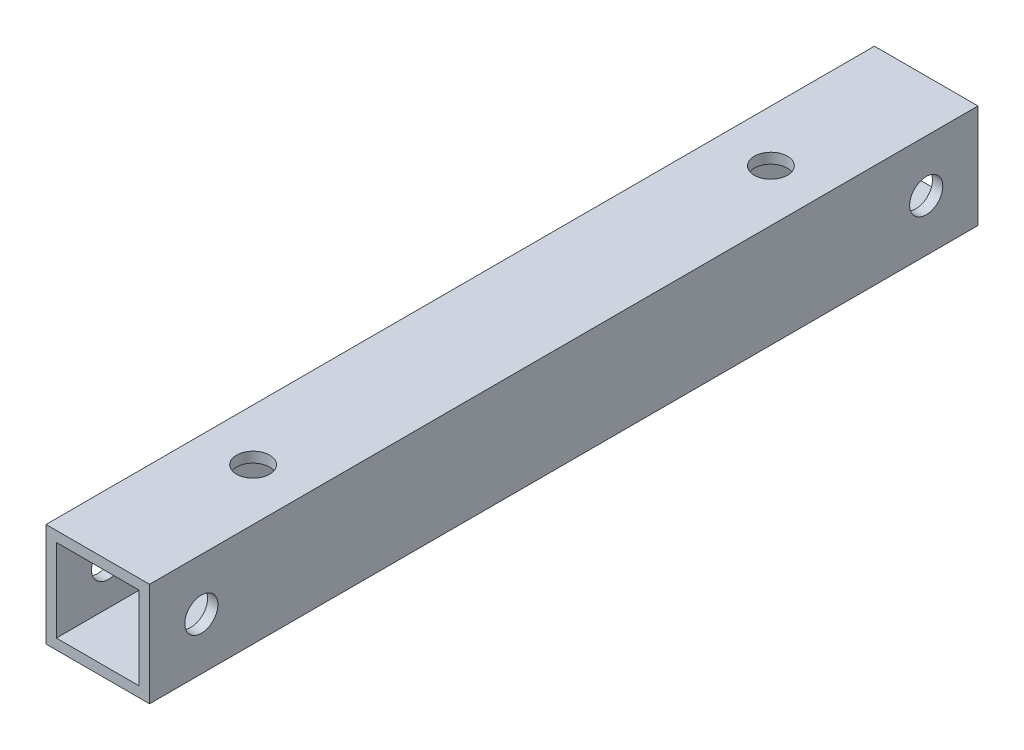
ISO-10303-21;
HEADER;
FILE_DESCRIPTION(('STEP AP214'),'2;1');
FILE_NAME('part.step','',(''),(''),'','','');
FILE_SCHEMA(('AUTOMOTIVE_DESIGN { 1 0 10303 214 1 1 1 1 }'));
ENDSEC;
DATA;
#1=APPLICATION_CONTEXT('core data for automotive mechanical design processes');
#2=APPLICATION_PROTOCOL_DEFINITION('international standard','automotive_design',2000,#1);
#3=PRODUCT_CONTEXT('',#1,'mechanical');
#4=PRODUCT('Part','Part','',(#3));
#5=PRODUCT_RELATED_PRODUCT_CATEGORY('part','',(#4));
#6=PRODUCT_DEFINITION_FORMATION('','',#4);
#7=PRODUCT_DEFINITION_CONTEXT('part definition',#1,'design');
#8=PRODUCT_DEFINITION('design','',#6,#7);
#9=PRODUCT_DEFINITION_SHAPE('','',#8);
#10=(LENGTH_UNIT() NAMED_UNIT(*) SI_UNIT(.MILLI.,.METRE.));
#11=(NAMED_UNIT(*) PLANE_ANGLE_UNIT() SI_UNIT($,.RADIAN.));
#12=(NAMED_UNIT(*) SI_UNIT($,.STERADIAN.) SOLID_ANGLE_UNIT());
#13=UNCERTAINTY_MEASURE_WITH_UNIT(LENGTH_MEASURE(1.E-05),#10,'distance_accuracy_value','');
#14=(GEOMETRIC_REPRESENTATION_CONTEXT(3) GLOBAL_UNCERTAINTY_ASSIGNED_CONTEXT((#13)) GLOBAL_UNIT_ASSIGNED_CONTEXT((#10,
#11,#12)) REPRESENTATION_CONTEXT('',''));
#15=CARTESIAN_POINT('',(0.,0.,0.));
#16=DIRECTION('',(0.,0.,1.));
#17=DIRECTION('',(1.,0.,0.));
#18=AXIS2_PLACEMENT_3D('',#15,#16,#17);
#19=CARTESIAN_POINT('',(0.,0.,0.));
#20=DIRECTION('',(0.,0.,-1.));
#21=DIRECTION('',(-1.,0.,0.));
#22=AXIS2_PLACEMENT_3D('',#19,#20,#21);
#23=PLANE('',#22);
#24=DIRECTION('',(0.,-1.,0.));
#25=VECTOR('',#24,1.);
#26=CARTESIAN_POINT('',(0.,0.,0.));
#27=LINE('',#26,#25);
#28=CARTESIAN_POINT('',(0.,10.,0.));
#29=VERTEX_POINT('',#28);
#30=CARTESIAN_POINT('',(0.,0.,0.));
#31=VERTEX_POINT('',#30);
#32=EDGE_CURVE('E110',#29,#31,#27,.T.);
#33=ORIENTED_EDGE('',*,*,#32,.F.);
#34=DIRECTION('',(-1.,0.,0.));
#35=VECTOR('',#34,1.);
#36=CARTESIAN_POINT('',(0.,10.,0.));
#37=LINE('',#36,#35);
#38=CARTESIAN_POINT('',(10.,10.,0.));
#39=VERTEX_POINT('',#38);
#40=EDGE_CURVE('E58',#39,#29,#37,.T.);
#41=ORIENTED_EDGE('',*,*,#40,.F.);
#42=DIRECTION('',(0.,1.,0.));
#43=VECTOR('',#42,1.);
#44=CARTESIAN_POINT('',(10.,0.,0.));
#45=LINE('',#44,#43);
#46=CARTESIAN_POINT('',(10.,0.,0.));
#47=VERTEX_POINT('',#46);
#48=EDGE_CURVE('E188',#47,#39,#45,.T.);
#49=ORIENTED_EDGE('',*,*,#48,.F.);
#50=DIRECTION('',(1.,0.,0.));
#51=VECTOR('',#50,1.);
#52=CARTESIAN_POINT('',(0.,0.,0.));
#53=LINE('',#52,#51);
#54=EDGE_CURVE('E186',#31,#47,#53,.T.);
#55=ORIENTED_EDGE('',*,*,#54,.F.);
#56=EDGE_LOOP('',(#33,#41,#49,#55));
#57=FACE_BOUND('',#56,.T.);
#58=DIRECTION('',(-1.,0.,0.));
#59=VECTOR('',#58,1.);
#60=CARTESIAN_POINT('',(1.,9.,0.));
#61=LINE('',#60,#59);
#62=CARTESIAN_POINT('',(9.,9.,0.));
#63=VERTEX_POINT('',#62);
#64=CARTESIAN_POINT('',(1.,9.,0.));
#65=VERTEX_POINT('',#64);
#66=EDGE_CURVE('E177',#63,#65,#61,.T.);
#67=ORIENTED_EDGE('',*,*,#66,.T.);
#68=DIRECTION('',(0.,-1.,0.));
#69=VECTOR('',#68,1.);
#70=CARTESIAN_POINT('',(1.,1.,0.));
#71=LINE('',#70,#69);
#72=CARTESIAN_POINT('',(1.,1.,0.));
#73=VERTEX_POINT('',#72);
#74=EDGE_CURVE('E50',#65,#73,#71,.T.);
#75=ORIENTED_EDGE('',*,*,#74,.T.);
#76=DIRECTION('',(1.,0.,0.));
#77=VECTOR('',#76,1.);
#78=CARTESIAN_POINT('',(1.,1.,0.));
#79=LINE('',#78,#77);
#80=CARTESIAN_POINT('',(9.,1.,0.));
#81=VERTEX_POINT('',#80);
#82=EDGE_CURVE('E109',#73,#81,#79,.T.);
#83=ORIENTED_EDGE('',*,*,#82,.T.);
#84=DIRECTION('',(0.,1.,0.));
#85=VECTOR('',#84,1.);
#86=CARTESIAN_POINT('',(9.,1.,0.));
#87=LINE('',#86,#85);
#88=EDGE_CURVE('E174',#81,#63,#87,.T.);
#89=ORIENTED_EDGE('',*,*,#88,.T.);
#90=EDGE_LOOP('',(#67,#75,#83,#89));
#91=FACE_BOUND('',#90,.T.);
#92=ADVANCED_FACE('F33',(#57,#91),#23,.T.);
#93=CARTESIAN_POINT('',(0.,0.,40.));
#94=DIRECTION('',(1.,0.,0.));
#95=DIRECTION('',(0.,0.,-1.));
#96=AXIS2_PLACEMENT_3D('',#93,#94,#95);
#97=PLANE('',#96);
#98=CARTESIAN_POINT('',(0.,5.,5.));
#99=DIRECTION('',(1.,0.,0.));
#100=DIRECTION('',(0.,0.,-1.));
#101=AXIS2_PLACEMENT_3D('',#98,#99,#100);
#102=CIRCLE('',#101,1.6);
#103=CARTESIAN_POINT('',(0.,5.,3.4));
#104=VERTEX_POINT('',#103);
#105=EDGE_CURVE('E163',#104,#104,#102,.T.);
#106=ORIENTED_EDGE('',*,*,#105,.T.);
#107=EDGE_LOOP('',(#106));
#108=FACE_BOUND('',#107,.T.);
#109=ORIENTED_EDGE('',*,*,#32,.T.);
#110=DIRECTION('',(0.,0.,-1.));
#111=VECTOR('',#110,1.);
#112=CARTESIAN_POINT('',(0.,0.,40.));
#113=LINE('',#112,#111);
#114=CARTESIAN_POINT('',(0.,0.,80.));
#115=VERTEX_POINT('',#114);
#116=EDGE_CURVE('E11',#115,#31,#113,.T.);
#117=ORIENTED_EDGE('',*,*,#116,.F.);
#118=DIRECTION('',(0.,-1.,0.));
#119=VECTOR('',#118,1.);
#120=CARTESIAN_POINT('',(0.,0.,80.));
#121=LINE('',#120,#119);
#122=CARTESIAN_POINT('',(0.,10.,80.));
#123=VERTEX_POINT('',#122);
#124=EDGE_CURVE('E132',#123,#115,#121,.T.);
#125=ORIENTED_EDGE('',*,*,#124,.F.);
#126=DIRECTION('',(0.,0.,-1.));
#127=VECTOR('',#126,1.);
#128=CARTESIAN_POINT('',(0.,10.,40.));
#129=LINE('',#128,#127);
#130=EDGE_CURVE('E191',#123,#29,#129,.T.);
#131=ORIENTED_EDGE('',*,*,#130,.T.);
#132=EDGE_LOOP('',(#109,#117,#125,#131));
#133=FACE_BOUND('',#132,.T.);
#134=CARTESIAN_POINT('',(0.,5.,75.));
#135=DIRECTION('',(-1.,0.,0.));
#136=DIRECTION('',(0.,0.,1.));
#137=AXIS2_PLACEMENT_3D('',#134,#135,#136);
#138=CIRCLE('',#137,1.6);
#139=CARTESIAN_POINT('',(0.,5.,76.6));
#140=VERTEX_POINT('',#139);
#141=EDGE_CURVE('E148',#140,#140,#138,.T.);
#142=ORIENTED_EDGE('',*,*,#141,.F.);
#143=EDGE_LOOP('',(#142));
#144=FACE_BOUND('',#143,.T.);
#145=ADVANCED_FACE('F35',(#108,#133,#144),#97,.F.);
#146=CARTESIAN_POINT('',(0.,0.,40.));
#147=DIRECTION('',(0.,1.,0.));
#148=DIRECTION('',(0.,0.,1.));
#149=AXIS2_PLACEMENT_3D('',#146,#147,#148);
#150=PLANE('',#149);
#151=CARTESIAN_POINT('',(5.,0.,15.));
#152=DIRECTION('',(0.,1.,0.));
#153=DIRECTION('',(0.,0.,1.));
#154=AXIS2_PLACEMENT_3D('',#151,#152,#153);
#155=CIRCLE('',#154,1.6);
#156=CARTESIAN_POINT('',(5.,0.,16.6));
#157=VERTEX_POINT('',#156);
#158=EDGE_CURVE('E154',#157,#157,#155,.T.);
#159=ORIENTED_EDGE('',*,*,#158,.T.);
#160=EDGE_LOOP('',(#159));
#161=FACE_BOUND('',#160,.T.);
#162=ORIENTED_EDGE('',*,*,#54,.T.);
#163=DIRECTION('',(0.,0.,-1.));
#164=VECTOR('',#163,1.);
#165=CARTESIAN_POINT('',(10.,0.,40.));
#166=LINE('',#165,#164);
#167=CARTESIAN_POINT('',(10.,0.,80.));
#168=VERTEX_POINT('',#167);
#169=EDGE_CURVE('E42',#168,#47,#166,.T.);
#170=ORIENTED_EDGE('',*,*,#169,.F.);
#171=DIRECTION('',(1.,0.,0.));
#172=VECTOR('',#171,1.);
#173=CARTESIAN_POINT('',(0.,0.,80.));
#174=LINE('',#173,#172);
#175=EDGE_CURVE('E135',#115,#168,#174,.T.);
#176=ORIENTED_EDGE('',*,*,#175,.F.);
#177=ORIENTED_EDGE('',*,*,#116,.T.);
#178=EDGE_LOOP('',(#162,#170,#176,#177));
#179=FACE_BOUND('',#178,.T.);
#180=CARTESIAN_POINT('',(5.,0.,65.));
#181=DIRECTION('',(0.,-1.,0.));
#182=DIRECTION('',(0.,0.,-1.));
#183=AXIS2_PLACEMENT_3D('',#180,#181,#182);
#184=CIRCLE('',#183,1.6);
#185=CARTESIAN_POINT('',(5.,0.,63.4));
#186=VERTEX_POINT('',#185);
#187=EDGE_CURVE('E153',#186,#186,#184,.T.);
#188=ORIENTED_EDGE('',*,*,#187,.F.);
#189=EDGE_LOOP('',(#188));
#190=FACE_BOUND('',#189,.T.);
#191=ADVANCED_FACE('F234',(#161,#179,#190),#150,.F.);
#192=CARTESIAN_POINT('',(10.,0.,40.));
#193=DIRECTION('',(-1.,0.,0.));
#194=DIRECTION('',(0.,0.,1.));
#195=AXIS2_PLACEMENT_3D('',#192,#193,#194);
#196=PLANE('',#195);
#197=CARTESIAN_POINT('',(10.,5.,5.));
#198=DIRECTION('',(1.,0.,0.));
#199=DIRECTION('',(0.,0.,-1.));
#200=AXIS2_PLACEMENT_3D('',#197,#198,#199);
#201=CIRCLE('',#200,1.6);
#202=CARTESIAN_POINT('',(10.,5.,3.4));
#203=VERTEX_POINT('',#202);
#204=EDGE_CURVE('E162',#203,#203,#201,.T.);
#205=ORIENTED_EDGE('',*,*,#204,.F.);
#206=EDGE_LOOP('',(#205));
#207=FACE_BOUND('',#206,.T.);
#208=ORIENTED_EDGE('',*,*,#48,.T.);
#209=DIRECTION('',(0.,0.,-1.));
#210=VECTOR('',#209,1.);
#211=CARTESIAN_POINT('',(10.,10.,40.));
#212=LINE('',#211,#210);
#213=CARTESIAN_POINT('',(10.,10.,80.));
#214=VERTEX_POINT('',#213);
#215=EDGE_CURVE('E193',#214,#39,#212,.T.);
#216=ORIENTED_EDGE('',*,*,#215,.F.);
#217=DIRECTION('',(0.,1.,0.));
#218=VECTOR('',#217,1.);
#219=CARTESIAN_POINT('',(10.,0.,80.));
#220=LINE('',#219,#218);
#221=EDGE_CURVE('E138',#168,#214,#220,.T.);
#222=ORIENTED_EDGE('',*,*,#221,.F.);
#223=ORIENTED_EDGE('',*,*,#169,.T.);
#224=EDGE_LOOP('',(#208,#216,#222,#223));
#225=FACE_BOUND('',#224,.T.);
#226=CARTESIAN_POINT('',(10.,5.,75.));
#227=DIRECTION('',(-1.,0.,0.));
#228=DIRECTION('',(0.,0.,1.));
#229=AXIS2_PLACEMENT_3D('',#226,#227,#228);
#230=CIRCLE('',#229,1.6);
#231=CARTESIAN_POINT('',(10.,5.,76.6));
#232=VERTEX_POINT('',#231);
#233=EDGE_CURVE('E218',#232,#232,#230,.T.);
#234=ORIENTED_EDGE('',*,*,#233,.T.);
#235=EDGE_LOOP('',(#234));
#236=FACE_BOUND('',#235,.T.);
#237=ADVANCED_FACE('F240',(#207,#225,#236),#196,.F.);
#238=CARTESIAN_POINT('',(0.,10.,40.));
#239=DIRECTION('',(0.,-1.,0.));
#240=DIRECTION('',(0.,0.,-1.));
#241=AXIS2_PLACEMENT_3D('',#238,#239,#240);
#242=PLANE('',#241);
#243=CARTESIAN_POINT('',(5.,10.,15.));
#244=DIRECTION('',(0.,1.,0.));
#245=DIRECTION('',(0.,0.,1.));
#246=AXIS2_PLACEMENT_3D('',#243,#244,#245);
#247=CIRCLE('',#246,1.6);
#248=CARTESIAN_POINT('',(5.,10.,16.6));
#249=VERTEX_POINT('',#248);
#250=EDGE_CURVE('E144',#249,#249,#247,.T.);
#251=ORIENTED_EDGE('',*,*,#250,.F.);
#252=EDGE_LOOP('',(#251));
#253=FACE_BOUND('',#252,.T.);
#254=ORIENTED_EDGE('',*,*,#40,.T.);
#255=ORIENTED_EDGE('',*,*,#130,.F.);
#256=DIRECTION('',(-1.,0.,0.));
#257=VECTOR('',#256,1.);
#258=CARTESIAN_POINT('',(0.,10.,80.));
#259=LINE('',#258,#257);
#260=EDGE_CURVE('E141',#214,#123,#259,.T.);
#261=ORIENTED_EDGE('',*,*,#260,.F.);
#262=ORIENTED_EDGE('',*,*,#215,.T.);
#263=EDGE_LOOP('',(#254,#255,#261,#262));
#264=FACE_BOUND('',#263,.T.);
#265=CARTESIAN_POINT('',(5.,10.,65.));
#266=DIRECTION('',(0.,-1.,0.));
#267=DIRECTION('',(0.,0.,-1.));
#268=AXIS2_PLACEMENT_3D('',#265,#266,#267);
#269=CIRCLE('',#268,1.6);
#270=CARTESIAN_POINT('',(5.,10.,63.4));
#271=VERTEX_POINT('',#270);
#272=EDGE_CURVE('E299',#271,#271,#269,.T.);
#273=ORIENTED_EDGE('',*,*,#272,.T.);
#274=EDGE_LOOP('',(#273));
#275=FACE_BOUND('',#274,.T.);
#276=ADVANCED_FACE('F256',(#253,#264,#275),#242,.F.);
#277=CARTESIAN_POINT('',(1.,1.,40.));
#278=DIRECTION('',(1.,0.,0.));
#279=DIRECTION('',(0.,0.,-1.));
#280=AXIS2_PLACEMENT_3D('',#277,#278,#279);
#281=PLANE('',#280);
#282=CARTESIAN_POINT('',(1.,5.,5.));
#283=DIRECTION('',(1.,0.,0.));
#284=DIRECTION('',(0.,0.,-1.));
#285=AXIS2_PLACEMENT_3D('',#282,#283,#284);
#286=CIRCLE('',#285,1.6);
#287=CARTESIAN_POINT('',(1.,5.,3.4));
#288=VERTEX_POINT('',#287);
#289=EDGE_CURVE('E169',#288,#288,#286,.T.);
#290=ORIENTED_EDGE('',*,*,#289,.F.);
#291=EDGE_LOOP('',(#290));
#292=FACE_BOUND('',#291,.T.);
#293=ORIENTED_EDGE('',*,*,#74,.F.);
#294=DIRECTION('',(0.,0.,-1.));
#295=VECTOR('',#294,1.);
#296=CARTESIAN_POINT('',(1.,9.,40.));
#297=LINE('',#296,#295);
#298=CARTESIAN_POINT('',(1.,9.,80.));
#299=VERTEX_POINT('',#298);
#300=EDGE_CURVE('E117',#299,#65,#297,.T.);
#301=ORIENTED_EDGE('',*,*,#300,.F.);
#302=DIRECTION('',(0.,-1.,0.));
#303=VECTOR('',#302,1.);
#304=CARTESIAN_POINT('',(1.,1.,80.));
#305=LINE('',#304,#303);
#306=CARTESIAN_POINT('',(1.,1.,80.));
#307=VERTEX_POINT('',#306);
#308=EDGE_CURVE('E114',#299,#307,#305,.T.);
#309=ORIENTED_EDGE('',*,*,#308,.T.);
#310=DIRECTION('',(0.,0.,-1.));
#311=VECTOR('',#310,1.);
#312=CARTESIAN_POINT('',(1.,1.,40.));
#313=LINE('',#312,#311);
#314=EDGE_CURVE('E101',#307,#73,#313,.T.);
#315=ORIENTED_EDGE('',*,*,#314,.T.);
#316=EDGE_LOOP('',(#293,#301,#309,#315));
#317=FACE_BOUND('',#316,.T.);
#318=CARTESIAN_POINT('',(1.,5.,75.));
#319=DIRECTION('',(-1.,0.,0.));
#320=DIRECTION('',(0.,0.,1.));
#321=AXIS2_PLACEMENT_3D('',#318,#319,#320);
#322=CIRCLE('',#321,1.6);
#323=CARTESIAN_POINT('',(1.,5.,76.6));
#324=VERTEX_POINT('',#323);
#325=EDGE_CURVE('E121',#324,#324,#322,.T.);
#326=ORIENTED_EDGE('',*,*,#325,.T.);
#327=EDGE_LOOP('',(#326));
#328=FACE_BOUND('',#327,.T.);
#329=ADVANCED_FACE('F115',(#292,#317,#328),#281,.T.);
#330=CARTESIAN_POINT('',(1.,1.,40.));
#331=DIRECTION('',(0.,1.,0.));
#332=DIRECTION('',(0.,0.,1.));
#333=AXIS2_PLACEMENT_3D('',#330,#331,#332);
#334=PLANE('',#333);
#335=CARTESIAN_POINT('',(5.,1.,15.));
#336=DIRECTION('',(0.,1.,0.));
#337=DIRECTION('',(0.,0.,1.));
#338=AXIS2_PLACEMENT_3D('',#335,#336,#337);
#339=CIRCLE('',#338,1.6);
#340=CARTESIAN_POINT('',(5.,1.,16.6));
#341=VERTEX_POINT('',#340);
#342=EDGE_CURVE('E159',#341,#341,#339,.T.);
#343=ORIENTED_EDGE('',*,*,#342,.F.);
#344=EDGE_LOOP('',(#343));
#345=FACE_BOUND('',#344,.T.);
#346=ORIENTED_EDGE('',*,*,#82,.F.);
#347=ORIENTED_EDGE('',*,*,#314,.F.);
#348=DIRECTION('',(1.,0.,0.));
#349=VECTOR('',#348,1.);
#350=CARTESIAN_POINT('',(1.,1.,80.));
#351=LINE('',#350,#349);
#352=CARTESIAN_POINT('',(9.,1.,80.));
#353=VERTEX_POINT('',#352);
#354=EDGE_CURVE('E106',#307,#353,#351,.T.);
#355=ORIENTED_EDGE('',*,*,#354,.T.);
#356=DIRECTION('',(0.,0.,-1.));
#357=VECTOR('',#356,1.);
#358=CARTESIAN_POINT('',(9.,1.,40.));
#359=LINE('',#358,#357);
#360=EDGE_CURVE('E111',#353,#81,#359,.T.);
#361=ORIENTED_EDGE('',*,*,#360,.T.);
#362=EDGE_LOOP('',(#346,#347,#355,#361));
#363=FACE_BOUND('',#362,.T.);
#364=CARTESIAN_POINT('',(5.,1.,65.));
#365=DIRECTION('',(0.,-1.,0.));
#366=DIRECTION('',(0.,0.,-1.));
#367=AXIS2_PLACEMENT_3D('',#364,#365,#366);
#368=CIRCLE('',#367,1.6);
#369=CARTESIAN_POINT('',(5.,1.,63.4));
#370=VERTEX_POINT('',#369);
#371=EDGE_CURVE('E152',#370,#370,#368,.T.);
#372=ORIENTED_EDGE('',*,*,#371,.T.);
#373=EDGE_LOOP('',(#372));
#374=FACE_BOUND('',#373,.T.);
#375=ADVANCED_FACE('F103',(#345,#363,#374),#334,.T.);
#376=CARTESIAN_POINT('',(9.,1.,40.));
#377=DIRECTION('',(-1.,0.,0.));
#378=DIRECTION('',(0.,0.,1.));
#379=AXIS2_PLACEMENT_3D('',#376,#377,#378);
#380=PLANE('',#379);
#381=CARTESIAN_POINT('',(9.,5.,5.));
#382=DIRECTION('',(-1.,0.,0.));
#383=DIRECTION('',(0.,0.,1.));
#384=AXIS2_PLACEMENT_3D('',#381,#382,#383);
#385=CIRCLE('',#384,1.6);
#386=CARTESIAN_POINT('',(9.,5.,6.6));
#387=VERTEX_POINT('',#386);
#388=EDGE_CURVE('E166',#387,#387,#385,.T.);
#389=ORIENTED_EDGE('',*,*,#388,.F.);
#390=EDGE_LOOP('',(#389));
#391=FACE_BOUND('',#390,.T.);
#392=ORIENTED_EDGE('',*,*,#88,.F.);
#393=ORIENTED_EDGE('',*,*,#360,.F.);
#394=DIRECTION('',(0.,1.,0.));
#395=VECTOR('',#394,1.);
#396=CARTESIAN_POINT('',(9.,1.,80.));
#397=LINE('',#396,#395);
#398=CARTESIAN_POINT('',(9.,9.,80.));
#399=VERTEX_POINT('',#398);
#400=EDGE_CURVE('E125',#353,#399,#397,.T.);
#401=ORIENTED_EDGE('',*,*,#400,.T.);
#402=DIRECTION('',(0.,0.,-1.));
#403=VECTOR('',#402,1.);
#404=CARTESIAN_POINT('',(9.,9.,40.));
#405=LINE('',#404,#403);
#406=EDGE_CURVE('E181',#399,#63,#405,.T.);
#407=ORIENTED_EDGE('',*,*,#406,.T.);
#408=EDGE_LOOP('',(#392,#393,#401,#407));
#409=FACE_BOUND('',#408,.T.);
#410=CARTESIAN_POINT('',(9.,5.,75.));
#411=DIRECTION('',(1.,0.,0.));
#412=DIRECTION('',(0.,0.,-1.));
#413=AXIS2_PLACEMENT_3D('',#410,#411,#412);
#414=CIRCLE('',#413,1.6);
#415=CARTESIAN_POINT('',(9.,5.,73.4));
#416=VERTEX_POINT('',#415);
#417=EDGE_CURVE('E145',#416,#416,#414,.T.);
#418=ORIENTED_EDGE('',*,*,#417,.T.);
#419=EDGE_LOOP('',(#418));
#420=FACE_BOUND('',#419,.T.);
#421=ADVANCED_FACE('F202',(#391,#409,#420),#380,.T.);
#422=CARTESIAN_POINT('',(1.,9.,40.));
#423=DIRECTION('',(0.,-1.,0.));
#424=DIRECTION('',(0.,0.,-1.));
#425=AXIS2_PLACEMENT_3D('',#422,#423,#424);
#426=PLANE('',#425);
#427=CARTESIAN_POINT('',(5.,9.,15.));
#428=DIRECTION('',(0.,-1.,0.));
#429=DIRECTION('',(0.,0.,-1.));
#430=AXIS2_PLACEMENT_3D('',#427,#428,#429);
#431=CIRCLE('',#430,1.6);
#432=CARTESIAN_POINT('',(5.,9.,13.4));
#433=VERTEX_POINT('',#432);
#434=EDGE_CURVE('E37',#433,#433,#431,.T.);
#435=ORIENTED_EDGE('',*,*,#434,.F.);
#436=EDGE_LOOP('',(#435));
#437=FACE_BOUND('',#436,.T.);
#438=ORIENTED_EDGE('',*,*,#66,.F.);
#439=ORIENTED_EDGE('',*,*,#406,.F.);
#440=DIRECTION('',(-1.,0.,0.));
#441=VECTOR('',#440,1.);
#442=CARTESIAN_POINT('',(1.,9.,80.));
#443=LINE('',#442,#441);
#444=EDGE_CURVE('E127',#399,#299,#443,.T.);
#445=ORIENTED_EDGE('',*,*,#444,.T.);
#446=ORIENTED_EDGE('',*,*,#300,.T.);
#447=EDGE_LOOP('',(#438,#439,#445,#446));
#448=FACE_BOUND('',#447,.T.);
#449=CARTESIAN_POINT('',(5.,9.,65.));
#450=DIRECTION('',(0.,1.,0.));
#451=DIRECTION('',(0.,0.,1.));
#452=AXIS2_PLACEMENT_3D('',#449,#450,#451);
#453=CIRCLE('',#452,1.6);
#454=CARTESIAN_POINT('',(5.,9.,66.6));
#455=VERTEX_POINT('',#454);
#456=EDGE_CURVE('E149',#455,#455,#453,.T.);
#457=ORIENTED_EDGE('',*,*,#456,.T.);
#458=EDGE_LOOP('',(#457));
#459=FACE_BOUND('',#458,.T.);
#460=ADVANCED_FACE('F205',(#437,#448,#459),#426,.T.);
#461=CARTESIAN_POINT('',(0.,5.,5.));
#462=DIRECTION('',(1.,0.,0.));
#463=DIRECTION('',(0.,0.,-1.));
#464=AXIS2_PLACEMENT_3D('',#461,#462,#463);
#465=CYLINDRICAL_SURFACE('',#464,1.6);
#466=ORIENTED_EDGE('',*,*,#388,.T.);
#467=EDGE_LOOP('',(#466));
#468=FACE_BOUND('',#467,.T.);
#469=ORIENTED_EDGE('',*,*,#204,.T.);
#470=EDGE_LOOP('',(#469));
#471=FACE_BOUND('',#470,.T.);
#472=ADVANCED_FACE('F199',(#468,#471),#465,.F.);
#473=ORIENTED_EDGE('',*,*,#289,.T.);
#474=EDGE_LOOP('',(#473));
#475=FACE_BOUND('',#474,.T.);
#476=ORIENTED_EDGE('',*,*,#105,.F.);
#477=EDGE_LOOP('',(#476));
#478=FACE_BOUND('',#477,.T.);
#479=ADVANCED_FACE('F280',(#475,#478),#465,.F.);
#480=CARTESIAN_POINT('',(5.,0.,15.));
#481=DIRECTION('',(0.,1.,0.));
#482=DIRECTION('',(0.,0.,1.));
#483=AXIS2_PLACEMENT_3D('',#480,#481,#482);
#484=CYLINDRICAL_SURFACE('',#483,1.6);
#485=ORIENTED_EDGE('',*,*,#434,.T.);
#486=EDGE_LOOP('',(#485));
#487=FACE_BOUND('',#486,.T.);
#488=ORIENTED_EDGE('',*,*,#250,.T.);
#489=EDGE_LOOP('',(#488));
#490=FACE_BOUND('',#489,.T.);
#491=ADVANCED_FACE('F281',(#487,#490),#484,.F.);
#492=ORIENTED_EDGE('',*,*,#342,.T.);
#493=EDGE_LOOP('',(#492));
#494=FACE_BOUND('',#493,.T.);
#495=ORIENTED_EDGE('',*,*,#158,.F.);
#496=EDGE_LOOP('',(#495));
#497=FACE_BOUND('',#496,.T.);
#498=ADVANCED_FACE('F284',(#494,#497),#484,.F.);
#499=CARTESIAN_POINT('',(0.,0.,80.));
#500=DIRECTION('',(0.,0.,1.));
#501=DIRECTION('',(-1.,0.,0.));
#502=AXIS2_PLACEMENT_3D('',#499,#500,#501);
#503=PLANE('',#502);
#504=ORIENTED_EDGE('',*,*,#124,.T.);
#505=ORIENTED_EDGE('',*,*,#175,.T.);
#506=ORIENTED_EDGE('',*,*,#221,.T.);
#507=ORIENTED_EDGE('',*,*,#260,.T.);
#508=EDGE_LOOP('',(#504,#505,#506,#507));
#509=FACE_BOUND('',#508,.T.);
#510=ORIENTED_EDGE('',*,*,#444,.F.);
#511=ORIENTED_EDGE('',*,*,#400,.F.);
#512=ORIENTED_EDGE('',*,*,#354,.F.);
#513=ORIENTED_EDGE('',*,*,#308,.F.);
#514=EDGE_LOOP('',(#510,#511,#512,#513));
#515=FACE_BOUND('',#514,.T.);
#516=ADVANCED_FACE('F123',(#509,#515),#503,.T.);
#517=CARTESIAN_POINT('',(0.,5.,75.));
#518=DIRECTION('',(1.,0.,0.));
#519=DIRECTION('',(0.,0.,1.));
#520=AXIS2_PLACEMENT_3D('',#517,#518,#519);
#521=CYLINDRICAL_SURFACE('',#520,1.6);
#522=ORIENTED_EDGE('',*,*,#417,.F.);
#523=EDGE_LOOP('',(#522));
#524=FACE_BOUND('',#523,.T.);
#525=ORIENTED_EDGE('',*,*,#233,.F.);
#526=EDGE_LOOP('',(#525));
#527=FACE_BOUND('',#526,.T.);
#528=ADVANCED_FACE('F211',(#524,#527),#521,.F.);
#529=ORIENTED_EDGE('',*,*,#325,.F.);
#530=EDGE_LOOP('',(#529));
#531=FACE_BOUND('',#530,.T.);
#532=ORIENTED_EDGE('',*,*,#141,.T.);
#533=EDGE_LOOP('',(#532));
#534=FACE_BOUND('',#533,.T.);
#535=ADVANCED_FACE('F214',(#531,#534),#521,.F.);
#536=CARTESIAN_POINT('',(5.,0.,65.));
#537=DIRECTION('',(0.,1.,0.));
#538=DIRECTION('',(0.,0.,-1.));
#539=AXIS2_PLACEMENT_3D('',#536,#537,#538);
#540=CYLINDRICAL_SURFACE('',#539,1.6);
#541=ORIENTED_EDGE('',*,*,#456,.F.);
#542=EDGE_LOOP('',(#541));
#543=FACE_BOUND('',#542,.T.);
#544=ORIENTED_EDGE('',*,*,#272,.F.);
#545=EDGE_LOOP('',(#544));
#546=FACE_BOUND('',#545,.T.);
#547=ADVANCED_FACE('F230',(#543,#546),#540,.F.);
#548=ORIENTED_EDGE('',*,*,#371,.F.);
#549=EDGE_LOOP('',(#548));
#550=FACE_BOUND('',#549,.T.);
#551=ORIENTED_EDGE('',*,*,#187,.T.);
#552=EDGE_LOOP('',(#551));
#553=FACE_BOUND('',#552,.T.);
#554=ADVANCED_FACE('F289',(#550,#553),#540,.F.);
#555=CLOSED_SHELL('',(#92,#145,#191,#237,#276,#329,#375,#421,#460,#472,#479,#491,#498,#516,#528,
#535,#547,#554));
#556=MANIFOLD_SOLID_BREP('B2',#555);
#557=ADVANCED_BREP_SHAPE_REPRESENTATION('',(#18,#556),#14);
#558=SHAPE_DEFINITION_REPRESENTATION(#9,#557);
ENDSEC;
END-ISO-10303-21;
